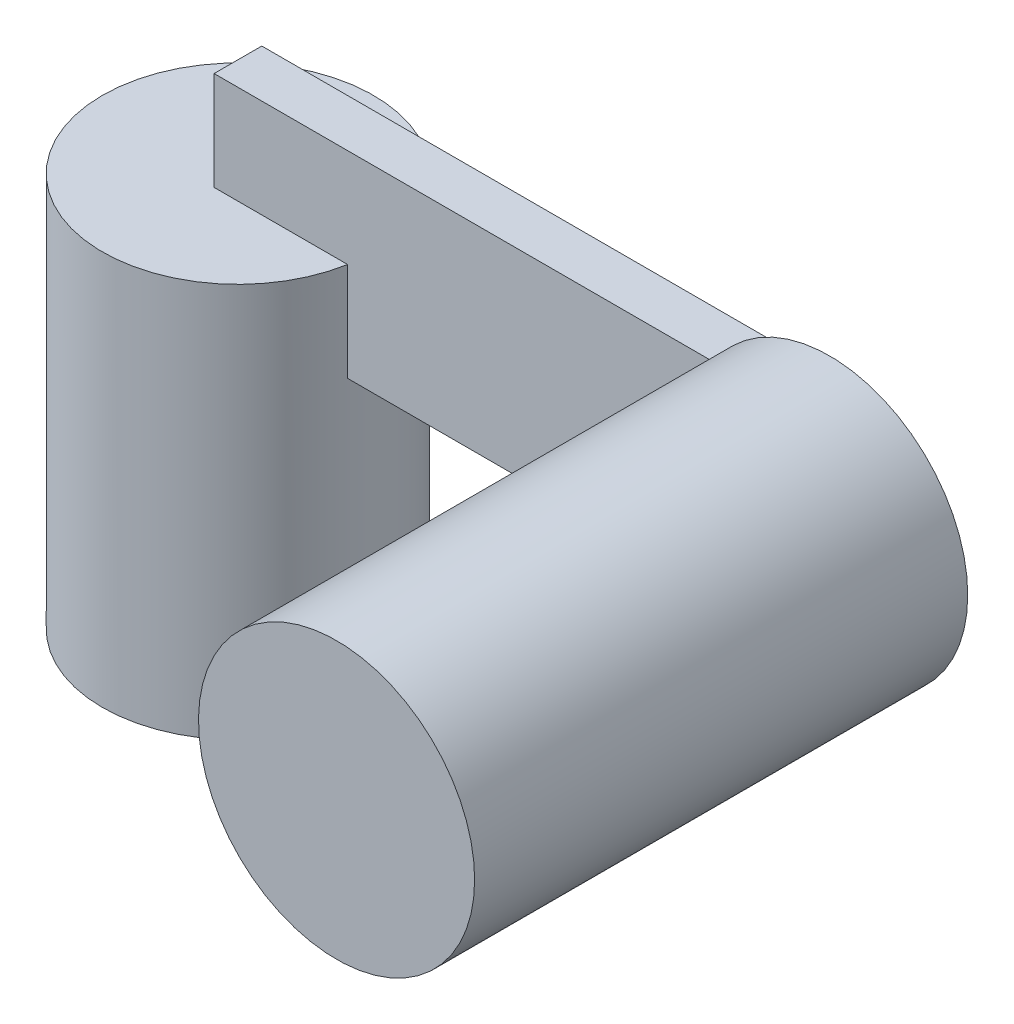
ISO-10303-21;
HEADER;
FILE_DESCRIPTION(('STEP AP214'),'2;1');
FILE_NAME('part.step','',(''),(''),'','','');
FILE_SCHEMA(('AUTOMOTIVE_DESIGN { 1 0 10303 214 1 1 1 1 }'));
ENDSEC;
DATA;
#1=APPLICATION_CONTEXT('core data for automotive mechanical design processes');
#2=APPLICATION_PROTOCOL_DEFINITION('international standard','automotive_design',2000,#1);
#3=PRODUCT_CONTEXT('',#1,'mechanical');
#4=PRODUCT('Part','Part','',(#3));
#5=PRODUCT_RELATED_PRODUCT_CATEGORY('part','',(#4));
#6=PRODUCT_DEFINITION_FORMATION('','',#4);
#7=PRODUCT_DEFINITION_CONTEXT('part definition',#1,'design');
#8=PRODUCT_DEFINITION('design','',#6,#7);
#9=PRODUCT_DEFINITION_SHAPE('','',#8);
#10=(LENGTH_UNIT() NAMED_UNIT(*) SI_UNIT(.MILLI.,.METRE.));
#11=(NAMED_UNIT(*) PLANE_ANGLE_UNIT() SI_UNIT($,.RADIAN.));
#12=(NAMED_UNIT(*) SI_UNIT($,.STERADIAN.) SOLID_ANGLE_UNIT());
#13=UNCERTAINTY_MEASURE_WITH_UNIT(LENGTH_MEASURE(1.E-05),#10,'distance_accuracy_value','');
#14=(GEOMETRIC_REPRESENTATION_CONTEXT(3) GLOBAL_UNCERTAINTY_ASSIGNED_CONTEXT((#13)) GLOBAL_UNIT_ASSIGNED_CONTEXT((#10,
#11,#12)) REPRESENTATION_CONTEXT('',''));
#15=CARTESIAN_POINT('',(0.,0.,0.));
#16=DIRECTION('',(0.,0.,1.));
#17=DIRECTION('',(1.,0.,0.));
#18=AXIS2_PLACEMENT_3D('',#15,#16,#17);
#19=CARTESIAN_POINT('',(30.,15.,1.20878285993578));
#20=DIRECTION('',(0.,1.,0.));
#21=DIRECTION('',(0.,0.,1.));
#22=AXIS2_PLACEMENT_3D('',#19,#20,#21);
#23=PLANE('',#22);
#24=DIRECTION('',(0.,0.,-1.));
#25=VECTOR('',#24,1.);
#26=CARTESIAN_POINT('',(25.1010205144336,15.,25.));
#27=LINE('',#26,#25);
#28=CARTESIAN_POINT('',(25.1010205144336,15.,1.20878285993578));
#29=VERTEX_POINT('',#28);
#30=CARTESIAN_POINT('',(25.1010205144336,15.,0.));
#31=VERTEX_POINT('',#30);
#32=EDGE_CURVE('E121',#29,#31,#27,.T.);
#33=ORIENTED_EDGE('',*,*,#32,.F.);
#34=DIRECTION('',(-1.,0.,0.));
#35=VECTOR('',#34,1.);
#36=CARTESIAN_POINT('',(30.,15.,1.20878285993578));
#37=LINE('',#36,#35);
#38=CARTESIAN_POINT('',(6.76789989564898,15.,1.20878285993578));
#39=VERTEX_POINT('',#38);
#40=EDGE_CURVE('E149',#29,#39,#37,.T.);
#41=ORIENTED_EDGE('',*,*,#40,.T.);
#42=CARTESIAN_POINT('',(0.,15.,0.));
#43=DIRECTION('',(0.,1.,0.));
#44=DIRECTION('',(0.,0.,1.));
#45=AXIS2_PLACEMENT_3D('',#42,#43,#44);
#46=CIRCLE('',#45,6.875);
#47=CARTESIAN_POINT('',(6.76789989564898,15.,-1.20878285993578));
#48=VERTEX_POINT('',#47);
#49=EDGE_CURVE('E179',#39,#48,#46,.T.);
#50=ORIENTED_EDGE('',*,*,#49,.T.);
#51=DIRECTION('',(-1.,0.,0.));
#52=VECTOR('',#51,1.);
#53=CARTESIAN_POINT('',(30.,15.,-1.20878285993578));
#54=LINE('',#53,#52);
#55=CARTESIAN_POINT('',(30.,15.,-1.20878285993578));
#56=VERTEX_POINT('',#55);
#57=EDGE_CURVE('E139',#56,#48,#54,.T.);
#58=ORIENTED_EDGE('',*,*,#57,.F.);
#59=DIRECTION('',(0.,0.,-1.));
#60=VECTOR('',#59,1.);
#61=CARTESIAN_POINT('',(30.,15.,1.20878285993578));
#62=LINE('',#61,#60);
#63=CARTESIAN_POINT('',(30.,15.,0.));
#64=VERTEX_POINT('',#63);
#65=EDGE_CURVE('E185',#64,#56,#62,.T.);
#66=ORIENTED_EDGE('',*,*,#65,.F.);
#67=DIRECTION('',(1.,0.,0.));
#68=VECTOR('',#67,1.);
#69=CARTESIAN_POINT('',(30.,15.,0.));
#70=LINE('',#69,#68);
#71=EDGE_CURVE('E58',#31,#64,#70,.T.);
#72=ORIENTED_EDGE('',*,*,#71,.F.);
#73=EDGE_LOOP('',(#33,#41,#50,#58,#66,#72));
#74=FACE_BOUND('',#73,.T.);
#75=ADVANCED_FACE('F42',(#74),#23,.F.);
#76=CARTESIAN_POINT('',(30.,25.,1.20878285993578));
#77=DIRECTION('',(0.,-1.,0.));
#78=DIRECTION('',(0.,0.,-1.));
#79=AXIS2_PLACEMENT_3D('',#76,#77,#78);
#80=PLANE('',#79);
#81=DIRECTION('',(0.,0.,-1.));
#82=VECTOR('',#81,1.);
#83=CARTESIAN_POINT('',(25.1010205144336,25.,25.));
#84=LINE('',#83,#82);
#85=CARTESIAN_POINT('',(25.1010205144336,25.,0.));
#86=VERTEX_POINT('',#85);
#87=CARTESIAN_POINT('',(25.1010205144336,25.,1.20878285993578));
#88=VERTEX_POINT('',#87);
#89=EDGE_CURVE('E11',#86,#88,#84,.F.);
#90=ORIENTED_EDGE('',*,*,#89,.F.);
#91=DIRECTION('',(-1.,0.,0.));
#92=VECTOR('',#91,1.);
#93=CARTESIAN_POINT('',(30.,25.,0.));
#94=LINE('',#93,#92);
#95=CARTESIAN_POINT('',(30.,25.,0.));
#96=VERTEX_POINT('',#95);
#97=EDGE_CURVE('E106',#96,#86,#94,.T.);
#98=ORIENTED_EDGE('',*,*,#97,.F.);
#99=DIRECTION('',(0.,0.,1.));
#100=VECTOR('',#99,1.);
#101=CARTESIAN_POINT('',(30.,25.,1.20878285993578));
#102=LINE('',#101,#100);
#103=CARTESIAN_POINT('',(30.,25.,-1.20878285993578));
#104=VERTEX_POINT('',#103);
#105=EDGE_CURVE('E135',#104,#96,#102,.T.);
#106=ORIENTED_EDGE('',*,*,#105,.F.);
#107=DIRECTION('',(-1.,0.,0.));
#108=VECTOR('',#107,1.);
#109=CARTESIAN_POINT('',(30.,25.,-1.20878285993578));
#110=LINE('',#109,#108);
#111=CARTESIAN_POINT('',(0.,25.,-1.20878285993578));
#112=VERTEX_POINT('',#111);
#113=EDGE_CURVE('E134',#104,#112,#110,.T.);
#114=ORIENTED_EDGE('',*,*,#113,.T.);
#115=DIRECTION('',(0.,0.,1.));
#116=VECTOR('',#115,1.);
#117=CARTESIAN_POINT('',(0.,25.,1.20878285993578));
#118=LINE('',#117,#116);
#119=CARTESIAN_POINT('',(0.,25.,1.20878285993578));
#120=VERTEX_POINT('',#119);
#121=EDGE_CURVE('E129',#112,#120,#118,.T.);
#122=ORIENTED_EDGE('',*,*,#121,.T.);
#123=DIRECTION('',(-1.,0.,0.));
#124=VECTOR('',#123,1.);
#125=CARTESIAN_POINT('',(30.,25.,1.20878285993578));
#126=LINE('',#125,#124);
#127=EDGE_CURVE('E127',#88,#120,#126,.T.);
#128=ORIENTED_EDGE('',*,*,#127,.F.);
#129=EDGE_LOOP('',(#90,#98,#106,#114,#122,#128));
#130=FACE_BOUND('',#129,.T.);
#131=ADVANCED_FACE('F125',(#130),#80,.F.);
#132=CARTESIAN_POINT('',(30.,0.,0.));
#133=DIRECTION('',(1.,0.,0.));
#134=DIRECTION('',(0.,0.,-1.));
#135=AXIS2_PLACEMENT_3D('',#132,#133,#134);
#136=PLANE('',#135);
#137=ORIENTED_EDGE('',*,*,#105,.T.);
#138=DIRECTION('',(0.,-1.,0.));
#139=VECTOR('',#138,1.);
#140=CARTESIAN_POINT('',(30.,0.,0.));
#141=LINE('',#140,#139);
#142=EDGE_CURVE('E51',#96,#64,#141,.T.);
#143=ORIENTED_EDGE('',*,*,#142,.T.);
#144=ORIENTED_EDGE('',*,*,#65,.T.);
#145=DIRECTION('',(0.,1.,0.));
#146=VECTOR('',#145,1.);
#147=CARTESIAN_POINT('',(30.,25.,-1.20878285993578));
#148=LINE('',#147,#146);
#149=EDGE_CURVE('E141',#56,#104,#148,.T.);
#150=ORIENTED_EDGE('',*,*,#149,.T.);
#151=EDGE_LOOP('',(#137,#143,#144,#150));
#152=FACE_BOUND('',#151,.T.);
#153=ADVANCED_FACE('F184',(#152),#136,.T.);
#154=CARTESIAN_POINT('',(0.,20.,0.));
#155=DIRECTION('',(0.,-1.,0.));
#156=DIRECTION('',(0.,0.,-1.));
#157=AXIS2_PLACEMENT_3D('',#154,#155,#156);
#158=CYLINDRICAL_SURFACE('',#157,6.875);
#159=CARTESIAN_POINT('',(0.,0.,0.));
#160=DIRECTION('',(0.,1.,0.));
#161=DIRECTION('',(0.,0.,1.));
#162=AXIS2_PLACEMENT_3D('',#159,#160,#161);
#163=CIRCLE('',#162,6.875);
#164=CARTESIAN_POINT('',(0.,0.,6.875));
#165=VERTEX_POINT('',#164);
#166=EDGE_CURVE('E159',#165,#165,#163,.T.);
#167=ORIENTED_EDGE('',*,*,#166,.T.);
#168=EDGE_LOOP('',(#167));
#169=FACE_BOUND('',#168,.T.);
#170=DIRECTION('',(0.,-1.,0.));
#171=VECTOR('',#170,1.);
#172=CARTESIAN_POINT('',(6.76789989564898,20.,1.20878285993578));
#173=LINE('',#172,#171);
#174=CARTESIAN_POINT('',(6.76789989564898,20.,1.20878285993578));
#175=VERTEX_POINT('',#174);
#176=EDGE_CURVE('E155',#175,#39,#173,.T.);
#177=ORIENTED_EDGE('',*,*,#176,.F.);
#178=CARTESIAN_POINT('',(0.,20.,0.));
#179=DIRECTION('',(0.,1.,0.));
#180=DIRECTION('',(0.,0.,1.));
#181=AXIS2_PLACEMENT_3D('',#178,#179,#180);
#182=CIRCLE('',#181,6.875);
#183=CARTESIAN_POINT('',(6.76789989564898,20.,-1.20878285993578));
#184=VERTEX_POINT('',#183);
#185=EDGE_CURVE('E160',#184,#175,#182,.T.);
#186=ORIENTED_EDGE('',*,*,#185,.F.);
#187=DIRECTION('',(0.,-1.,0.));
#188=VECTOR('',#187,1.);
#189=CARTESIAN_POINT('',(6.76789989564898,20.,-1.20878285993578));
#190=LINE('',#189,#188);
#191=EDGE_CURVE('E152',#48,#184,#190,.F.);
#192=ORIENTED_EDGE('',*,*,#191,.F.);
#193=ORIENTED_EDGE('',*,*,#49,.F.);
#194=EDGE_LOOP('',(#177,#186,#192,#193));
#195=FACE_BOUND('',#194,.T.);
#196=ADVANCED_FACE('F44',(#169,#195),#158,.T.);
#197=CARTESIAN_POINT('',(0.,20.,0.));
#198=DIRECTION('',(0.,1.,0.));
#199=DIRECTION('',(0.,0.,1.));
#200=AXIS2_PLACEMENT_3D('',#197,#198,#199);
#201=PLANE('',#200);
#202=ORIENTED_EDGE('',*,*,#185,.T.);
#203=DIRECTION('',(-1.,0.,0.));
#204=VECTOR('',#203,1.);
#205=CARTESIAN_POINT('',(0.,20.,1.20878285993578));
#206=LINE('',#205,#204);
#207=CARTESIAN_POINT('',(0.,20.,1.20878285993578));
#208=VERTEX_POINT('',#207);
#209=EDGE_CURVE('E175',#175,#208,#206,.T.);
#210=ORIENTED_EDGE('',*,*,#209,.T.);
#211=DIRECTION('',(0.,0.,-1.));
#212=VECTOR('',#211,1.);
#213=CARTESIAN_POINT('',(0.,20.,0.));
#214=LINE('',#213,#212);
#215=CARTESIAN_POINT('',(0.,20.,-1.20878285993578));
#216=VERTEX_POINT('',#215);
#217=EDGE_CURVE('E164',#208,#216,#214,.T.);
#218=ORIENTED_EDGE('',*,*,#217,.T.);
#219=DIRECTION('',(1.,0.,0.));
#220=VECTOR('',#219,1.);
#221=CARTESIAN_POINT('',(0.,20.,-1.20878285993578));
#222=LINE('',#221,#220);
#223=EDGE_CURVE('E171',#216,#184,#222,.T.);
#224=ORIENTED_EDGE('',*,*,#223,.T.);
#225=EDGE_LOOP('',(#202,#210,#218,#224));
#226=FACE_BOUND('',#225,.T.);
#227=ADVANCED_FACE('F207',(#226),#201,.T.);
#228=CARTESIAN_POINT('',(0.,0.,0.));
#229=DIRECTION('',(0.,1.,0.));
#230=DIRECTION('',(0.,0.,1.));
#231=AXIS2_PLACEMENT_3D('',#228,#229,#230);
#232=PLANE('',#231);
#233=ORIENTED_EDGE('',*,*,#166,.F.);
#234=EDGE_LOOP('',(#233));
#235=FACE_BOUND('',#234,.T.);
#236=ADVANCED_FACE('F244',(#235),#232,.F.);
#237=CARTESIAN_POINT('',(30.,25.,1.20878285993578));
#238=DIRECTION('',(0.,0.,-1.));
#239=DIRECTION('',(0.,1.,0.));
#240=AXIS2_PLACEMENT_3D('',#237,#238,#239);
#241=PLANE('',#240);
#242=CARTESIAN_POINT('',(30.,20.,1.20878285993578));
#243=DIRECTION('',(0.,0.,-1.));
#244=DIRECTION('',(0.,1.,0.));
#245=AXIS2_PLACEMENT_3D('',#242,#243,#244);
#246=CIRCLE('',#245,7.);
#247=EDGE_CURVE('E213',#88,#29,#246,.F.);
#248=ORIENTED_EDGE('',*,*,#247,.F.);
#249=ORIENTED_EDGE('',*,*,#127,.T.);
#250=DIRECTION('',(0.,-1.,0.));
#251=VECTOR('',#250,1.);
#252=CARTESIAN_POINT('',(0.,25.,1.20878285993578));
#253=LINE('',#252,#251);
#254=EDGE_CURVE('E197',#120,#208,#253,.T.);
#255=ORIENTED_EDGE('',*,*,#254,.T.);
#256=ORIENTED_EDGE('',*,*,#209,.F.);
#257=ORIENTED_EDGE('',*,*,#176,.T.);
#258=ORIENTED_EDGE('',*,*,#40,.F.);
#259=EDGE_LOOP('',(#248,#249,#255,#256,#257,#258));
#260=FACE_BOUND('',#259,.T.);
#261=ADVANCED_FACE('F204',(#260),#241,.F.);
#262=CARTESIAN_POINT('',(30.,25.,-1.20878285993578));
#263=DIRECTION('',(0.,0.,1.));
#264=DIRECTION('',(0.,-1.,0.));
#265=AXIS2_PLACEMENT_3D('',#262,#263,#264);
#266=PLANE('',#265);
#267=ORIENTED_EDGE('',*,*,#57,.T.);
#268=ORIENTED_EDGE('',*,*,#191,.T.);
#269=ORIENTED_EDGE('',*,*,#223,.F.);
#270=DIRECTION('',(0.,1.,0.));
#271=VECTOR('',#270,1.);
#272=CARTESIAN_POINT('',(0.,25.,-1.20878285993578));
#273=LINE('',#272,#271);
#274=EDGE_CURVE('E66',#216,#112,#273,.T.);
#275=ORIENTED_EDGE('',*,*,#274,.T.);
#276=ORIENTED_EDGE('',*,*,#113,.F.);
#277=ORIENTED_EDGE('',*,*,#149,.F.);
#278=EDGE_LOOP('',(#267,#268,#269,#275,#276,#277));
#279=FACE_BOUND('',#278,.T.);
#280=ADVANCED_FACE('F202',(#279),#266,.F.);
#281=CARTESIAN_POINT('',(0.,0.,0.));
#282=DIRECTION('',(1.,0.,0.));
#283=DIRECTION('',(0.,0.,-1.));
#284=AXIS2_PLACEMENT_3D('',#281,#282,#283);
#285=PLANE('',#284);
#286=ORIENTED_EDGE('',*,*,#217,.F.);
#287=ORIENTED_EDGE('',*,*,#254,.F.);
#288=ORIENTED_EDGE('',*,*,#121,.F.);
#289=ORIENTED_EDGE('',*,*,#274,.F.);
#290=EDGE_LOOP('',(#286,#287,#288,#289));
#291=FACE_BOUND('',#290,.T.);
#292=ADVANCED_FACE('F203',(#291),#285,.F.);
#293=CARTESIAN_POINT('',(30.,20.,25.));
#294=DIRECTION('',(0.,0.,-1.));
#295=DIRECTION('',(-1.,0.,0.));
#296=AXIS2_PLACEMENT_3D('',#293,#294,#295);
#297=CYLINDRICAL_SURFACE('',#296,7.);
#298=CARTESIAN_POINT('',(30.,20.,25.));
#299=DIRECTION('',(0.,0.,1.));
#300=DIRECTION('',(1.,0.,0.));
#301=AXIS2_PLACEMENT_3D('',#298,#299,#300);
#302=CIRCLE('',#301,7.);
#303=CARTESIAN_POINT('',(37.,20.,25.));
#304=VERTEX_POINT('',#303);
#305=EDGE_CURVE('E115',#304,#304,#302,.T.);
#306=ORIENTED_EDGE('',*,*,#305,.F.);
#307=EDGE_LOOP('',(#306));
#308=FACE_BOUND('',#307,.T.);
#309=ORIENTED_EDGE('',*,*,#247,.T.);
#310=ORIENTED_EDGE('',*,*,#32,.T.);
#311=CARTESIAN_POINT('',(30.,20.,0.));
#312=DIRECTION('',(0.,0.,1.));
#313=DIRECTION('',(1.,0.,0.));
#314=AXIS2_PLACEMENT_3D('',#311,#312,#313);
#315=CIRCLE('',#314,7.);
#316=EDGE_CURVE('E109',#31,#86,#315,.T.);
#317=ORIENTED_EDGE('',*,*,#316,.T.);
#318=ORIENTED_EDGE('',*,*,#89,.T.);
#319=EDGE_LOOP('',(#309,#310,#317,#318));
#320=FACE_BOUND('',#319,.T.);
#321=ADVANCED_FACE('F118',(#308,#320),#297,.T.);
#322=CARTESIAN_POINT('',(30.,20.,0.));
#323=DIRECTION('',(0.,0.,1.));
#324=DIRECTION('',(1.,0.,0.));
#325=AXIS2_PLACEMENT_3D('',#322,#323,#324);
#326=PLANE('',#325);
#327=ORIENTED_EDGE('',*,*,#316,.F.);
#328=ORIENTED_EDGE('',*,*,#71,.T.);
#329=ORIENTED_EDGE('',*,*,#142,.F.);
#330=ORIENTED_EDGE('',*,*,#97,.T.);
#331=EDGE_LOOP('',(#327,#328,#329,#330));
#332=FACE_BOUND('',#331,.T.);
#333=ADVANCED_FACE('F108',(#332),#326,.F.);
#334=CARTESIAN_POINT('',(30.,20.,25.));
#335=DIRECTION('',(0.,0.,1.));
#336=DIRECTION('',(1.,0.,0.));
#337=AXIS2_PLACEMENT_3D('',#334,#335,#336);
#338=PLANE('',#337);
#339=ORIENTED_EDGE('',*,*,#305,.T.);
#340=EDGE_LOOP('',(#339));
#341=FACE_BOUND('',#340,.T.);
#342=ADVANCED_FACE('F223',(#341),#338,.T.);
#343=CLOSED_SHELL('',(#75,#131,#153,#196,#227,#236,#261,#280,#292,#321,#333,#342));
#344=MANIFOLD_SOLID_BREP('B2',#343);
#345=ADVANCED_BREP_SHAPE_REPRESENTATION('',(#18,#344),#14);
#346=SHAPE_DEFINITION_REPRESENTATION(#9,#345);
ENDSEC;
END-ISO-10303-21;
